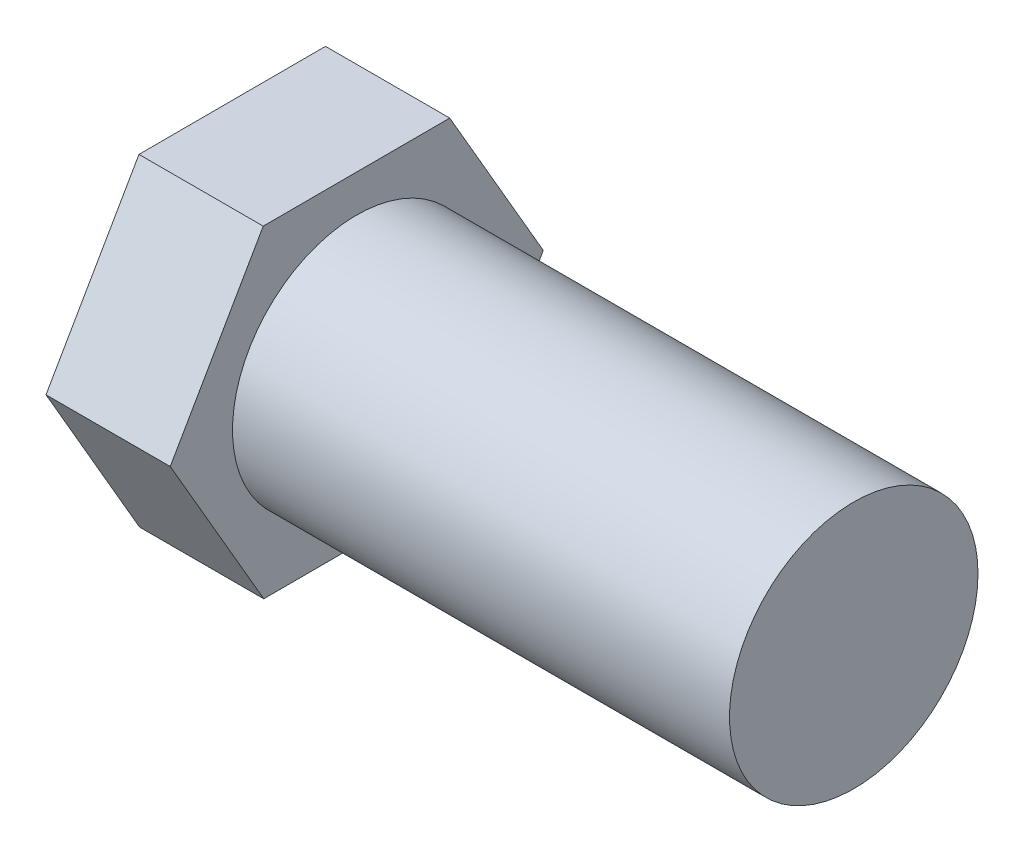
ISO-10303-21;
HEADER;
FILE_DESCRIPTION(('STEP AP214'),'2;1');
FILE_NAME('part.step','',(''),(''),'','','');
FILE_SCHEMA(('AUTOMOTIVE_DESIGN { 1 0 10303 214 1 1 1 1 }'));
ENDSEC;
DATA;
#1=APPLICATION_CONTEXT('core data for automotive mechanical design processes');
#2=APPLICATION_PROTOCOL_DEFINITION('international standard','automotive_design',2000,#1);
#3=PRODUCT_CONTEXT('',#1,'mechanical');
#4=PRODUCT('Part','Part','',(#3));
#5=PRODUCT_RELATED_PRODUCT_CATEGORY('part','',(#4));
#6=PRODUCT_DEFINITION_FORMATION('','',#4);
#7=PRODUCT_DEFINITION_CONTEXT('part definition',#1,'design');
#8=PRODUCT_DEFINITION('design','',#6,#7);
#9=PRODUCT_DEFINITION_SHAPE('','',#8);
#10=(LENGTH_UNIT() NAMED_UNIT(*) SI_UNIT(.MILLI.,.METRE.));
#11=(NAMED_UNIT(*) PLANE_ANGLE_UNIT() SI_UNIT($,.RADIAN.));
#12=(NAMED_UNIT(*) SI_UNIT($,.STERADIAN.) SOLID_ANGLE_UNIT());
#13=UNCERTAINTY_MEASURE_WITH_UNIT(LENGTH_MEASURE(1.E-05),#10,'distance_accuracy_value','');
#14=(GEOMETRIC_REPRESENTATION_CONTEXT(3) GLOBAL_UNCERTAINTY_ASSIGNED_CONTEXT((#13)) GLOBAL_UNIT_ASSIGNED_CONTEXT((#10,
#11,#12)) REPRESENTATION_CONTEXT('',''));
#15=CARTESIAN_POINT('',(0.,0.,0.));
#16=DIRECTION('',(0.,0.,1.));
#17=DIRECTION('',(1.,0.,0.));
#18=AXIS2_PLACEMENT_3D('',#15,#16,#17);
#19=CARTESIAN_POINT('',(5.,-6.493354565523,-3.76426351624529));
#20=DIRECTION('',(1.,0.,0.));
#21=DIRECTION('',(0.,0.,-1.));
#22=AXIS2_PLACEMENT_3D('',#19,#20,#21);
#23=PLANE('',#22);
#24=DIRECTION('',(0.,0.00176809729579639,-0.999998436914755));
#25=VECTOR('',#24,1.);
#26=CARTESIAN_POINT('',(5.,-6.50662511436886,3.74127825139993));
#27=LINE('',#26,#25);
#28=CARTESIAN_POINT('',(5.,-6.50662511436886,3.74127825139993));
#29=VERTEX_POINT('',#28);
#30=CARTESIAN_POINT('',(5.,-6.493354565523,-3.76426351624529));
#31=VERTEX_POINT('',#30);
#32=EDGE_CURVE('E127',#29,#31,#27,.T.);
#33=ORIENTED_EDGE('',*,*,#32,.T.);
#34=DIRECTION('',(0.,0.866908098760806,-0.498468001282855));
#35=VECTOR('',#34,1.);
#36=CARTESIAN_POINT('',(5.,-6.493354565523,-3.76426351624529));
#37=LINE('',#36,#35);
#38=CARTESIAN_POINT('',(5.,0.0132705488458604,-7.50554176764523));
#39=VERTEX_POINT('',#38);
#40=EDGE_CURVE('E85',#31,#39,#37,.T.);
#41=ORIENTED_EDGE('',*,*,#40,.T.);
#42=DIRECTION('',(0.,0.86514000146501,0.501530435631899));
#43=VECTOR('',#42,1.);
#44=CARTESIAN_POINT('',(5.,0.0132705488458604,-7.50554176764523));
#45=LINE('',#44,#43);
#46=CARTESIAN_POINT('',(5.,6.50662511436886,-3.74127825139994));
#47=VERTEX_POINT('',#46);
#48=EDGE_CURVE('E98',#39,#47,#45,.T.);
#49=ORIENTED_EDGE('',*,*,#48,.T.);
#50=DIRECTION('',(0.,-0.00176809729579628,0.999998436914755));
#51=VECTOR('',#50,1.);
#52=CARTESIAN_POINT('',(5.,6.50662511436886,-3.74127825139994));
#53=LINE('',#52,#51);
#54=CARTESIAN_POINT('',(5.,6.493354565523,3.76426351624529));
#55=VERTEX_POINT('',#54);
#56=EDGE_CURVE('E92',#47,#55,#53,.T.);
#57=ORIENTED_EDGE('',*,*,#56,.T.);
#58=DIRECTION('',(0.,-0.866908098760806,0.498468001282855));
#59=VECTOR('',#58,1.);
#60=CARTESIAN_POINT('',(5.,6.493354565523,3.76426351624529));
#61=LINE('',#60,#59);
#62=CARTESIAN_POINT('',(5.,-0.0132705488458604,7.50554176764523));
#63=VERTEX_POINT('',#62);
#64=EDGE_CURVE('E96',#55,#63,#61,.T.);
#65=ORIENTED_EDGE('',*,*,#64,.T.);
#66=DIRECTION('',(0.,-0.86514000146501,-0.5015304356319));
#67=VECTOR('',#66,1.);
#68=CARTESIAN_POINT('',(5.,-0.0132705488458604,7.50554176764523));
#69=LINE('',#68,#67);
#70=EDGE_CURVE('E48',#63,#29,#69,.T.);
#71=ORIENTED_EDGE('',*,*,#70,.T.);
#72=EDGE_LOOP('',(#33,#41,#49,#57,#65,#71));
#73=FACE_BOUND('',#72,.T.);
#74=CARTESIAN_POINT('',(5.,0.,0.));
#75=DIRECTION('',(1.,0.,0.));
#76=DIRECTION('',(0.,0.,-1.));
#77=AXIS2_PLACEMENT_3D('',#74,#75,#76);
#78=CIRCLE('',#77,5.);
#79=CARTESIAN_POINT('',(5.,0.,-5.));
#80=VERTEX_POINT('',#79);
#81=EDGE_CURVE('E167',#80,#80,#78,.T.);
#82=ORIENTED_EDGE('',*,*,#81,.F.);
#83=EDGE_LOOP('',(#82));
#84=FACE_BOUND('',#83,.T.);
#85=ADVANCED_FACE('F31',(#73,#84),#23,.T.);
#86=CARTESIAN_POINT('',(5.,-6.50662511436886,3.74127825139993));
#87=DIRECTION('',(0.,0.999998436914755,0.00176809729579639));
#88=DIRECTION('',(0.,-0.00176809729579639,0.999998436914755));
#89=AXIS2_PLACEMENT_3D('',#86,#87,#88);
#90=PLANE('',#89);
#91=DIRECTION('',(0.,0.00176809729579639,-0.999998436914755));
#92=VECTOR('',#91,1.);
#93=CARTESIAN_POINT('',(0.,-6.50662511436886,3.74127825139993));
#94=LINE('',#93,#92);
#95=CARTESIAN_POINT('',(0.,-6.50662511436886,3.74127825139993));
#96=VERTEX_POINT('',#95);
#97=CARTESIAN_POINT('',(0.,-6.493354565523,-3.76426351624529));
#98=VERTEX_POINT('',#97);
#99=EDGE_CURVE('E116',#96,#98,#94,.T.);
#100=ORIENTED_EDGE('',*,*,#99,.T.);
#101=DIRECTION('',(-1.,0.,0.));
#102=VECTOR('',#101,1.);
#103=CARTESIAN_POINT('',(5.,-6.493354565523,-3.76426351624529));
#104=LINE('',#103,#102);
#105=EDGE_CURVE('E11',#31,#98,#104,.T.);
#106=ORIENTED_EDGE('',*,*,#105,.F.);
#107=ORIENTED_EDGE('',*,*,#32,.F.);
#108=DIRECTION('',(-1.,0.,0.));
#109=VECTOR('',#108,1.);
#110=CARTESIAN_POINT('',(5.,-6.50662511436886,3.74127825139993));
#111=LINE('',#110,#109);
#112=EDGE_CURVE('E112',#29,#96,#111,.T.);
#113=ORIENTED_EDGE('',*,*,#112,.T.);
#114=EDGE_LOOP('',(#100,#106,#107,#113));
#115=FACE_BOUND('',#114,.T.);
#116=ADVANCED_FACE('F33',(#115),#90,.F.);
#117=CARTESIAN_POINT('',(5.,-6.493354565523,-3.76426351624529));
#118=DIRECTION('',(0.,0.498468001282855,0.866908098760806));
#119=DIRECTION('',(0.,-0.866908098760806,0.498468001282855));
#120=AXIS2_PLACEMENT_3D('',#117,#118,#119);
#121=PLANE('',#120);
#122=DIRECTION('',(0.,0.866908098760806,-0.498468001282855));
#123=VECTOR('',#122,1.);
#124=CARTESIAN_POINT('',(0.,-6.493354565523,-3.76426351624529));
#125=LINE('',#124,#123);
#126=CARTESIAN_POINT('',(0.,0.0132705488458604,-7.50554176764523));
#127=VERTEX_POINT('',#126);
#128=EDGE_CURVE('E119',#98,#127,#125,.T.);
#129=ORIENTED_EDGE('',*,*,#128,.T.);
#130=DIRECTION('',(-1.,0.,0.));
#131=VECTOR('',#130,1.);
#132=CARTESIAN_POINT('',(5.,0.0132705488458604,-7.50554176764523));
#133=LINE('',#132,#131);
#134=EDGE_CURVE('E40',#39,#127,#133,.T.);
#135=ORIENTED_EDGE('',*,*,#134,.F.);
#136=ORIENTED_EDGE('',*,*,#40,.F.);
#137=ORIENTED_EDGE('',*,*,#105,.T.);
#138=EDGE_LOOP('',(#129,#135,#136,#137));
#139=FACE_BOUND('',#138,.T.);
#140=ADVANCED_FACE('F155',(#139),#121,.F.);
#141=CARTESIAN_POINT('',(5.,0.0132705488458604,-7.50554176764523));
#142=DIRECTION('',(0.,-0.501530435631899,0.86514000146501));
#143=DIRECTION('',(0.,-0.86514000146501,-0.501530435631899));
#144=AXIS2_PLACEMENT_3D('',#141,#142,#143);
#145=PLANE('',#144);
#146=DIRECTION('',(0.,0.86514000146501,0.501530435631899));
#147=VECTOR('',#146,1.);
#148=CARTESIAN_POINT('',(0.,0.0132705488458604,-7.50554176764523));
#149=LINE('',#148,#147);
#150=CARTESIAN_POINT('',(0.,6.50662511436886,-3.74127825139994));
#151=VERTEX_POINT('',#150);
#152=EDGE_CURVE('E122',#127,#151,#149,.T.);
#153=ORIENTED_EDGE('',*,*,#152,.T.);
#154=DIRECTION('',(-1.,0.,0.));
#155=VECTOR('',#154,1.);
#156=CARTESIAN_POINT('',(5.,6.50662511436886,-3.74127825139994));
#157=LINE('',#156,#155);
#158=EDGE_CURVE('E107',#47,#151,#157,.T.);
#159=ORIENTED_EDGE('',*,*,#158,.F.);
#160=ORIENTED_EDGE('',*,*,#48,.F.);
#161=ORIENTED_EDGE('',*,*,#134,.T.);
#162=EDGE_LOOP('',(#153,#159,#160,#161));
#163=FACE_BOUND('',#162,.T.);
#164=ADVANCED_FACE('F133',(#163),#145,.F.);
#165=CARTESIAN_POINT('',(5.,6.50662511436886,-3.74127825139994));
#166=DIRECTION('',(0.,-0.999998436914755,-0.00176809729579628));
#167=DIRECTION('',(0.,0.00176809729579628,-0.999998436914755));
#168=AXIS2_PLACEMENT_3D('',#165,#166,#167);
#169=PLANE('',#168);
#170=DIRECTION('',(0.,-0.00176809729579628,0.999998436914755));
#171=VECTOR('',#170,1.);
#172=CARTESIAN_POINT('',(0.,6.50662511436886,-3.74127825139994));
#173=LINE('',#172,#171);
#174=CARTESIAN_POINT('',(0.,6.493354565523,3.76426351624529));
#175=VERTEX_POINT('',#174);
#176=EDGE_CURVE('E106',#151,#175,#173,.T.);
#177=ORIENTED_EDGE('',*,*,#176,.T.);
#178=DIRECTION('',(-1.,0.,0.));
#179=VECTOR('',#178,1.);
#180=CARTESIAN_POINT('',(5.,6.493354565523,3.76426351624529));
#181=LINE('',#180,#179);
#182=EDGE_CURVE('E103',#55,#175,#181,.T.);
#183=ORIENTED_EDGE('',*,*,#182,.F.);
#184=ORIENTED_EDGE('',*,*,#56,.F.);
#185=ORIENTED_EDGE('',*,*,#158,.T.);
#186=EDGE_LOOP('',(#177,#183,#184,#185));
#187=FACE_BOUND('',#186,.T.);
#188=ADVANCED_FACE('F104',(#187),#169,.F.);
#189=CARTESIAN_POINT('',(5.,6.493354565523,3.76426351624529));
#190=DIRECTION('',(0.,-0.498468001282855,-0.866908098760806));
#191=DIRECTION('',(0.,0.866908098760806,-0.498468001282855));
#192=AXIS2_PLACEMENT_3D('',#189,#190,#191);
#193=PLANE('',#192);
#194=DIRECTION('',(0.,-0.866908098760806,0.498468001282855));
#195=VECTOR('',#194,1.);
#196=CARTESIAN_POINT('',(0.,6.493354565523,3.76426351624529));
#197=LINE('',#196,#195);
#198=CARTESIAN_POINT('',(0.,-0.0132705488458604,7.50554176764523));
#199=VERTEX_POINT('',#198);
#200=EDGE_CURVE('E71',#175,#199,#197,.T.);
#201=ORIENTED_EDGE('',*,*,#200,.T.);
#202=DIRECTION('',(-1.,0.,0.));
#203=VECTOR('',#202,1.);
#204=CARTESIAN_POINT('',(5.,-0.0132705488458604,7.50554176764523));
#205=LINE('',#204,#203);
#206=EDGE_CURVE('E108',#63,#199,#205,.T.);
#207=ORIENTED_EDGE('',*,*,#206,.F.);
#208=ORIENTED_EDGE('',*,*,#64,.F.);
#209=ORIENTED_EDGE('',*,*,#182,.T.);
#210=EDGE_LOOP('',(#201,#207,#208,#209));
#211=FACE_BOUND('',#210,.T.);
#212=ADVANCED_FACE('F110',(#211),#193,.F.);
#213=CARTESIAN_POINT('',(5.,-0.0132705488458604,7.50554176764523));
#214=DIRECTION('',(0.,0.5015304356319,-0.86514000146501));
#215=DIRECTION('',(0.,0.86514000146501,0.5015304356319));
#216=AXIS2_PLACEMENT_3D('',#213,#214,#215);
#217=PLANE('',#216);
#218=DIRECTION('',(0.,-0.86514000146501,-0.5015304356319));
#219=VECTOR('',#218,1.);
#220=CARTESIAN_POINT('',(0.,-0.0132705488458604,7.50554176764523));
#221=LINE('',#220,#219);
#222=EDGE_CURVE('E77',#199,#96,#221,.T.);
#223=ORIENTED_EDGE('',*,*,#222,.T.);
#224=ORIENTED_EDGE('',*,*,#112,.F.);
#225=ORIENTED_EDGE('',*,*,#70,.F.);
#226=ORIENTED_EDGE('',*,*,#206,.T.);
#227=EDGE_LOOP('',(#223,#224,#225,#226));
#228=FACE_BOUND('',#227,.T.);
#229=ADVANCED_FACE('F140',(#228),#217,.F.);
#230=CARTESIAN_POINT('',(0.,-6.493354565523,-3.76426351624529));
#231=DIRECTION('',(1.,0.,0.));
#232=DIRECTION('',(0.,0.,-1.));
#233=AXIS2_PLACEMENT_3D('',#230,#231,#232);
#234=PLANE('',#233);
#235=ORIENTED_EDGE('',*,*,#99,.F.);
#236=ORIENTED_EDGE('',*,*,#222,.F.);
#237=ORIENTED_EDGE('',*,*,#200,.F.);
#238=ORIENTED_EDGE('',*,*,#176,.F.);
#239=ORIENTED_EDGE('',*,*,#152,.F.);
#240=ORIENTED_EDGE('',*,*,#128,.F.);
#241=EDGE_LOOP('',(#235,#236,#237,#238,#239,#240));
#242=FACE_BOUND('',#241,.T.);
#243=ADVANCED_FACE('F136',(#242),#234,.F.);
#244=CARTESIAN_POINT('',(25.,0.,0.));
#245=DIRECTION('',(-1.,0.,0.));
#246=DIRECTION('',(0.,0.,1.));
#247=AXIS2_PLACEMENT_3D('',#244,#245,#246);
#248=CYLINDRICAL_SURFACE('',#247,5.);
#249=CARTESIAN_POINT('',(25.,0.,0.));
#250=DIRECTION('',(1.,0.,0.));
#251=DIRECTION('',(0.,0.,-1.));
#252=AXIS2_PLACEMENT_3D('',#249,#250,#251);
#253=CIRCLE('',#252,5.);
#254=CARTESIAN_POINT('',(25.,0.,-5.));
#255=VERTEX_POINT('',#254);
#256=EDGE_CURVE('E120',#255,#255,#253,.T.);
#257=ORIENTED_EDGE('',*,*,#256,.F.);
#258=EDGE_LOOP('',(#257));
#259=FACE_BOUND('',#258,.T.);
#260=ORIENTED_EDGE('',*,*,#81,.T.);
#261=EDGE_LOOP('',(#260));
#262=FACE_BOUND('',#261,.T.);
#263=ADVANCED_FACE('F147',(#259,#262),#248,.T.);
#264=CARTESIAN_POINT('',(25.,0.,0.));
#265=DIRECTION('',(1.,0.,0.));
#266=DIRECTION('',(0.,0.,-1.));
#267=AXIS2_PLACEMENT_3D('',#264,#265,#266);
#268=PLANE('',#267);
#269=ORIENTED_EDGE('',*,*,#256,.T.);
#270=EDGE_LOOP('',(#269));
#271=FACE_BOUND('',#270,.T.);
#272=ADVANCED_FACE('F159',(#271),#268,.T.);
#273=CLOSED_SHELL('',(#85,#116,#140,#164,#188,#212,#229,#243,#263,#272));
#274=MANIFOLD_SOLID_BREP('B2',#273);
#275=ADVANCED_BREP_SHAPE_REPRESENTATION('',(#18,#274),#14);
#276=SHAPE_DEFINITION_REPRESENTATION(#9,#275);
ENDSEC;
END-ISO-10303-21;
